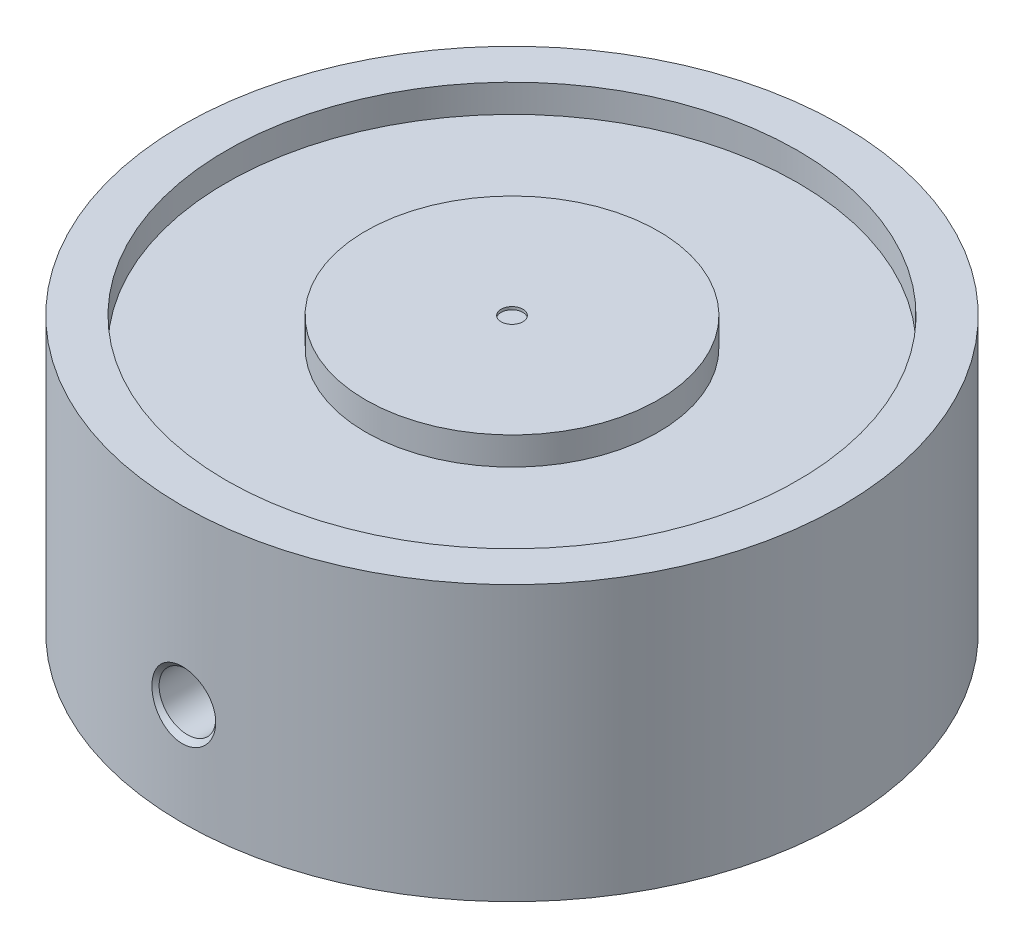
ISO-10303-21;
HEADER;
FILE_DESCRIPTION(('STEP AP214'),'2;1');
FILE_NAME('part.step','',(''),(''),'','','');
FILE_SCHEMA(('AUTOMOTIVE_DESIGN { 1 0 10303 214 1 1 1 1 }'));
ENDSEC;
DATA;
#1=APPLICATION_CONTEXT('core data for automotive mechanical design processes');
#2=APPLICATION_PROTOCOL_DEFINITION('international standard','automotive_design',2000,#1);
#3=PRODUCT_CONTEXT('',#1,'mechanical');
#4=PRODUCT('Part','Part','',(#3));
#5=PRODUCT_RELATED_PRODUCT_CATEGORY('part','',(#4));
#6=PRODUCT_DEFINITION_FORMATION('','',#4);
#7=PRODUCT_DEFINITION_CONTEXT('part definition',#1,'design');
#8=PRODUCT_DEFINITION('design','',#6,#7);
#9=PRODUCT_DEFINITION_SHAPE('','',#8);
#10=(LENGTH_UNIT() NAMED_UNIT(*) SI_UNIT(.MILLI.,.METRE.));
#11=(NAMED_UNIT(*) PLANE_ANGLE_UNIT() SI_UNIT($,.RADIAN.));
#12=(NAMED_UNIT(*) SI_UNIT($,.STERADIAN.) SOLID_ANGLE_UNIT());
#13=UNCERTAINTY_MEASURE_WITH_UNIT(LENGTH_MEASURE(1.E-05),#10,'distance_accuracy_value','');
#14=(GEOMETRIC_REPRESENTATION_CONTEXT(3) GLOBAL_UNCERTAINTY_ASSIGNED_CONTEXT((#13)) GLOBAL_UNIT_ASSIGNED_CONTEXT((#10,
#11,#12)) REPRESENTATION_CONTEXT('',''));
#15=CARTESIAN_POINT('',(0.,0.,0.));
#16=DIRECTION('',(0.,0.,1.));
#17=DIRECTION('',(1.,0.,0.));
#18=AXIS2_PLACEMENT_3D('',#15,#16,#17);
#19=CARTESIAN_POINT('',(-1.00409375,12.2555,-1.00409375));
#20=DIRECTION('',(0.,1.,0.));
#21=DIRECTION('',(0.,0.,1.));
#22=AXIS2_PLACEMENT_3D('',#19,#20,#21);
#23=PLANE('',#22);
#24=CARTESIAN_POINT('',(0.,12.2555,0.));
#25=DIRECTION('',(0.,1.,0.));
#26=DIRECTION('',(0.,0.,1.));
#27=AXIS2_PLACEMENT_3D('',#24,#25,#26);
#28=CIRCLE('',#27,0.9921875);
#29=CARTESIAN_POINT('',(0.,12.2555,0.9921875));
#30=VERTEX_POINT('',#29);
#31=EDGE_CURVE('E20',#30,#30,#28,.F.);
#32=ORIENTED_EDGE('',*,*,#31,.F.);
#33=EDGE_LOOP('',(#32));
#34=FACE_BOUND('',#33,.T.);
#35=ADVANCED_FACE('F16',(#34),#23,.T.);
#36=CARTESIAN_POINT('',(0.,12.2555,0.));
#37=DIRECTION('',(0.,1.,0.));
#38=DIRECTION('',(0.,0.,1.));
#39=AXIS2_PLACEMENT_3D('',#36,#37,#38);
#40=CYLINDRICAL_SURFACE('',#39,0.9921875);
#41=CARTESIAN_POINT('',(0.,12.5095,0.));
#42=DIRECTION('',(0.,1.,0.));
#43=DIRECTION('',(0.,0.,1.));
#44=AXIS2_PLACEMENT_3D('',#41,#42,#43);
#45=CIRCLE('',#44,0.9921875);
#46=CARTESIAN_POINT('',(0.,12.5095,0.9921875));
#47=VERTEX_POINT('',#46);
#48=EDGE_CURVE('E49',#47,#47,#45,.F.);
#49=ORIENTED_EDGE('',*,*,#48,.F.);
#50=EDGE_LOOP('',(#49));
#51=FACE_BOUND('',#50,.T.);
#52=ORIENTED_EDGE('',*,*,#31,.T.);
#53=EDGE_LOOP('',(#52));
#54=FACE_BOUND('',#53,.T.);
#55=ADVANCED_FACE('F166',(#51,#54),#40,.F.);
#56=CARTESIAN_POINT('',(-13.49502,12.5095,-13.49502));
#57=DIRECTION('',(0.,1.,0.));
#58=DIRECTION('',(0.,0.,1.));
#59=AXIS2_PLACEMENT_3D('',#56,#57,#58);
#60=PLANE('',#59);
#61=ORIENTED_EDGE('',*,*,#48,.T.);
#62=EDGE_LOOP('',(#61));
#63=FACE_BOUND('',#62,.T.);
#64=CARTESIAN_POINT('',(0.,12.5095,0.));
#65=DIRECTION('',(0.,1.,0.));
#66=DIRECTION('',(0.,0.,1.));
#67=AXIS2_PLACEMENT_3D('',#64,#65,#66);
#68=CIRCLE('',#67,13.335);
#69=CARTESIAN_POINT('',(0.,12.5095,13.335));
#70=VERTEX_POINT('',#69);
#71=EDGE_CURVE('E43',#70,#70,#68,.T.);
#72=ORIENTED_EDGE('',*,*,#71,.T.);
#73=EDGE_LOOP('',(#72));
#74=FACE_BOUND('',#73,.T.);
#75=ADVANCED_FACE('F36',(#63,#74),#60,.T.);
#76=CARTESIAN_POINT('',(0.,3.5055892042,0.));
#77=DIRECTION('',(0.,-1.,0.));
#78=DIRECTION('',(0.,0.,-1.));
#79=AXIS2_PLACEMENT_3D('',#76,#77,#78);
#80=CONICAL_SURFACE('',#79,0.,1.02974425840082);
#81=CARTESIAN_POINT('',(0.,3.5055892042,0.));
#82=VERTEX_POINT('',#81);
#83=VERTEX_LOOP('',#82);
#84=FACE_BOUND('',#83,.T.);
#85=CARTESIAN_POINT('',(0.,1.4605,0.));
#86=DIRECTION('',(0.,-1.,0.));
#87=DIRECTION('',(0.,0.,-1.));
#88=AXIS2_PLACEMENT_3D('',#85,#86,#87);
#89=CIRCLE('',#88,3.4036);
#90=CARTESIAN_POINT('',(0.,1.4605,-3.4036));
#91=VERTEX_POINT('',#90);
#92=EDGE_CURVE('E40',#91,#91,#89,.F.);
#93=ORIENTED_EDGE('',*,*,#92,.F.);
#94=EDGE_LOOP('',(#93));
#95=FACE_BOUND('',#94,.T.);
#96=ADVANCED_FACE('F32',(#84,#95),#80,.F.);
#97=CARTESIAN_POINT('',(0.,9.9695,0.));
#98=DIRECTION('',(0.,1.,0.));
#99=DIRECTION('',(0.,0.,1.));
#100=AXIS2_PLACEMENT_3D('',#97,#98,#99);
#101=CYLINDRICAL_SURFACE('',#100,13.335);
#102=CARTESIAN_POINT('',(0.,9.9695,0.));
#103=DIRECTION('',(0.,1.,0.));
#104=DIRECTION('',(0.,0.,1.));
#105=AXIS2_PLACEMENT_3D('',#102,#103,#104);
#106=CIRCLE('',#105,13.335);
#107=CARTESIAN_POINT('',(0.,9.9695,13.335));
#108=VERTEX_POINT('',#107);
#109=EDGE_CURVE('E42',#108,#108,#106,.F.);
#110=ORIENTED_EDGE('',*,*,#109,.F.);
#111=EDGE_LOOP('',(#110));
#112=FACE_BOUND('',#111,.T.);
#113=ORIENTED_EDGE('',*,*,#71,.F.);
#114=EDGE_LOOP('',(#113));
#115=FACE_BOUND('',#114,.T.);
#116=ADVANCED_FACE('F35',(#112,#115),#101,.T.);
#117=CARTESIAN_POINT('',(0.,1.4605,0.));
#118=DIRECTION('',(0.,-1.,0.));
#119=DIRECTION('',(0.,0.,-1.));
#120=AXIS2_PLACEMENT_3D('',#117,#118,#119);
#121=CYLINDRICAL_SURFACE('',#120,3.4036);
#122=ORIENTED_EDGE('',*,*,#92,.T.);
#123=EDGE_LOOP('',(#122));
#124=FACE_BOUND('',#123,.T.);
#125=CARTESIAN_POINT('',(0.,-11.8490999999999,0.));
#126=DIRECTION('',(0.,-1.,0.));
#127=DIRECTION('',(0.,0.,-1.));
#128=AXIS2_PLACEMENT_3D('',#125,#126,#127);
#129=CIRCLE('',#128,3.4036);
#130=CARTESIAN_POINT('',(0.,-11.8491,-3.4036));
#131=VERTEX_POINT('',#130);
#132=EDGE_CURVE('E46',#131,#131,#129,.F.);
#133=ORIENTED_EDGE('',*,*,#132,.F.);
#134=EDGE_LOOP('',(#133));
#135=FACE_BOUND('',#134,.T.);
#136=ADVANCED_FACE('F141',(#124,#135),#121,.F.);
#137=CARTESIAN_POINT('',(-26.34742,9.9695,-26.34742));
#138=DIRECTION('',(0.,1.,0.));
#139=DIRECTION('',(0.,0.,1.));
#140=AXIS2_PLACEMENT_3D('',#137,#138,#139);
#141=PLANE('',#140);
#142=ORIENTED_EDGE('',*,*,#109,.T.);
#143=EDGE_LOOP('',(#142));
#144=FACE_BOUND('',#143,.T.);
#145=CARTESIAN_POINT('',(0.,9.9695,0.));
#146=DIRECTION('',(0.,1.,0.));
#147=DIRECTION('',(0.,0.,1.));
#148=AXIS2_PLACEMENT_3D('',#145,#146,#147);
#149=CIRCLE('',#148,26.035);
#150=CARTESIAN_POINT('',(0.,9.9695,26.035));
#151=VERTEX_POINT('',#150);
#152=EDGE_CURVE('E189',#151,#151,#149,.F.);
#153=ORIENTED_EDGE('',*,*,#152,.F.);
#154=EDGE_LOOP('',(#153));
#155=FACE_BOUND('',#154,.T.);
#156=ADVANCED_FACE('F133',(#144,#155),#141,.T.);
#157=CARTESIAN_POINT('',(0.,-11.8491,0.));
#158=DIRECTION('',(0.,-1.,0.));
#159=DIRECTION('',(0.,0.,-1.));
#160=AXIS2_PLACEMENT_3D('',#157,#158,#159);
#161=CONICAL_SURFACE('',#160,3.4036,0.785398163397447);
#162=ORIENTED_EDGE('',*,*,#132,.T.);
#163=EDGE_LOOP('',(#162));
#164=FACE_BOUND('',#163,.T.);
#165=CARTESIAN_POINT('',(0.,-12.5095,0.));
#166=DIRECTION('',(0.,-1.,0.));
#167=DIRECTION('',(0.,0.,-1.));
#168=AXIS2_PLACEMENT_3D('',#165,#166,#167);
#169=CIRCLE('',#168,4.06399999999995);
#170=CARTESIAN_POINT('',(0.,-12.5095,-4.06399999999995));
#171=VERTEX_POINT('',#170);
#172=EDGE_CURVE('E192',#171,#171,#169,.T.);
#173=ORIENTED_EDGE('',*,*,#172,.T.);
#174=EDGE_LOOP('',(#173));
#175=FACE_BOUND('',#174,.T.);
#176=ADVANCED_FACE('F126',(#164,#175),#161,.F.);
#177=CARTESIAN_POINT('',(0.,9.9695,0.));
#178=DIRECTION('',(0.,1.,0.));
#179=DIRECTION('',(0.,0.,1.));
#180=AXIS2_PLACEMENT_3D('',#177,#178,#179);
#181=CYLINDRICAL_SURFACE('',#180,26.035);
#182=CARTESIAN_POINT('',(0.,12.5095,0.));
#183=DIRECTION('',(0.,1.,0.));
#184=DIRECTION('',(0.,0.,1.));
#185=AXIS2_PLACEMENT_3D('',#182,#183,#184);
#186=CIRCLE('',#185,26.035);
#187=CARTESIAN_POINT('',(0.,12.5095,26.035));
#188=VERTEX_POINT('',#187);
#189=EDGE_CURVE('E195',#188,#188,#186,.F.);
#190=ORIENTED_EDGE('',*,*,#189,.F.);
#191=EDGE_LOOP('',(#190));
#192=FACE_BOUND('',#191,.T.);
#193=ORIENTED_EDGE('',*,*,#152,.T.);
#194=EDGE_LOOP('',(#193));
#195=FACE_BOUND('',#194,.T.);
#196=ADVANCED_FACE('F119',(#192,#195),#181,.F.);
#197=CARTESIAN_POINT('',(-30.4023522,-12.5095,-30.4023522));
#198=DIRECTION('',(0.,1.,0.));
#199=DIRECTION('',(0.,0.,1.));
#200=AXIS2_PLACEMENT_3D('',#197,#198,#199);
#201=PLANE('',#200);
#202=ORIENTED_EDGE('',*,*,#172,.F.);
#203=EDGE_LOOP('',(#202));
#204=FACE_BOUND('',#203,.T.);
#205=CARTESIAN_POINT('',(0.,-12.5095,0.));
#206=DIRECTION('',(0.,-1.,0.));
#207=DIRECTION('',(0.,0.,-1.));
#208=AXIS2_PLACEMENT_3D('',#205,#206,#207);
#209=CIRCLE('',#208,30.04185);
#210=CARTESIAN_POINT('',(0.,-12.5095,-30.04185));
#211=VERTEX_POINT('',#210);
#212=EDGE_CURVE('E197',#211,#211,#209,.T.);
#213=ORIENTED_EDGE('',*,*,#212,.T.);
#214=EDGE_LOOP('',(#213));
#215=FACE_BOUND('',#214,.T.);
#216=ADVANCED_FACE('F112',(#204,#215),#201,.F.);
#217=CARTESIAN_POINT('',(-30.4023522,12.5095,-30.4023522));
#218=DIRECTION('',(0.,1.,0.));
#219=DIRECTION('',(0.,0.,1.));
#220=AXIS2_PLACEMENT_3D('',#217,#218,#219);
#221=PLANE('',#220);
#222=ORIENTED_EDGE('',*,*,#189,.T.);
#223=EDGE_LOOP('',(#222));
#224=FACE_BOUND('',#223,.T.);
#225=CARTESIAN_POINT('',(0.,12.5095,0.));
#226=DIRECTION('',(0.,-1.,0.));
#227=DIRECTION('',(0.,0.,-1.));
#228=AXIS2_PLACEMENT_3D('',#225,#226,#227);
#229=CIRCLE('',#228,30.04185);
#230=CARTESIAN_POINT('',(0.,12.5095,-30.04185));
#231=VERTEX_POINT('',#230);
#232=EDGE_CURVE('E60',#231,#231,#229,.F.);
#233=ORIENTED_EDGE('',*,*,#232,.T.);
#234=EDGE_LOOP('',(#233));
#235=FACE_BOUND('',#234,.T.);
#236=ADVANCED_FACE('F18',(#224,#235),#221,.T.);
#237=CARTESIAN_POINT('',(0.,12.5095,0.));
#238=DIRECTION('',(0.,-1.,0.));
#239=DIRECTION('',(0.,0.,-1.));
#240=AXIS2_PLACEMENT_3D('',#237,#238,#239);
#241=CYLINDRICAL_SURFACE('',#240,30.04185);
#242=ORIENTED_EDGE('',*,*,#212,.F.);
#243=EDGE_LOOP('',(#242));
#244=FACE_BOUND('',#243,.T.);
#245=CARTESIAN_POINT('',(-2.90701938102084,-3.21309974719248,29.9008693810208));
#246=CARTESIAN_POINT('',(-2.90701466575819,-3.39106134422876,29.9008708116393));
#247=CARTESIAN_POINT('',(-2.89209141647851,-3.56908913245919,29.9023322521782));
#248=CARTESIAN_POINT('',(-2.8326889731572,-3.92018869767745,29.9080171469593));
#249=CARTESIAN_POINT('',(-2.78819120462545,-4.09325728870451,29.9122423369678));
#250=CARTESIAN_POINT('',(-2.67065304054812,-4.42921519042932,29.9229649011047));
#251=CARTESIAN_POINT('',(-2.59763534161678,-4.59211247634534,29.9294604679999));
#252=CARTESIAN_POINT('',(-2.42473663554425,-4.90288406404577,29.9439625630061));
#253=CARTESIAN_POINT('',(-2.32486202959417,-5.0507619340667,29.9519687309385));
#254=CARTESIAN_POINT('',(-2.10325484559262,-5.32354894124232,29.9683349620311));
#255=CARTESIAN_POINT('',(-1.98207084447528,-5.44890384522508,29.9766828408072));
#256=CARTESIAN_POINT('',(-1.71945231647923,-5.67639507957893,29.9928905441293));
#257=CARTESIAN_POINT('',(-1.57801626860532,-5.77852966453557,30.0007503319544));
#258=CARTESIAN_POINT('',(-1.28541520240291,-5.9518511133594,30.0146794110718));
#259=CARTESIAN_POINT('',(-1.13492696562868,-6.02417675988089,30.0208110038938));
#260=CARTESIAN_POINT('',(-0.823652643988981,-6.14109062487776,30.030958097121));
#261=CARTESIAN_POINT('',(-0.662886642341278,-6.18573121778938,30.0349775909691));
#262=CARTESIAN_POINT('',(-0.417209317301813,-6.23076819327773,30.0390669018534));
#263=CARTESIAN_POINT('',(-0.334189428977145,-6.24212741269829,30.0401069141277));
#264=CARTESIAN_POINT('',(-0.167458990930617,-6.25729500176058,30.0414988779427));
#265=CARTESIAN_POINT('',(-0.0837484936323983,-6.2611039393383,30.0418508812357));
#266=CARTESIAN_POINT('',(0.151325292577853,-6.2610921690496,30.0418484076936));
#267=CARTESIAN_POINT('',(0.302774631453907,-6.2486351237024,30.0406946847928));
#268=CARTESIAN_POINT('',(0.601721182252781,-6.19920373586845,30.0361968229132));
#269=CARTESIAN_POINT('',(0.749212510909281,-6.16219479469729,30.0328495929117));
#270=CARTESIAN_POINT('',(1.04014280312083,-6.06359349704171,30.0242001851937));
#271=CARTESIAN_POINT('',(1.18336457569443,-6.00136388697314,30.0188476262427));
#272=CARTESIAN_POINT('',(1.45769231862119,-5.85451088401947,30.0067787691962));
#273=CARTESIAN_POINT('',(1.58879950023848,-5.76988973320397,30.0000626076542));
#274=CARTESIAN_POINT('',(1.8397415765954,-5.57792797453848,29.9857367800663));
#275=CARTESIAN_POINT('',(1.95909214459001,-5.46995641854923,29.9781056530212));
#276=CARTESIAN_POINT('',(2.17896481260718,-5.23627388227085,29.9629277910211));
#277=CARTESIAN_POINT('',(2.27948030861383,-5.11055670694055,29.9553810865354));
#278=CARTESIAN_POINT('',(2.46378412078416,-4.83865900991901,29.9407996626287));
#279=CARTESIAN_POINT('',(2.54656806611231,-4.69179569375851,29.9338054978109));
#280=CARTESIAN_POINT('',(2.68738715881765,-4.38665207798738,29.9214926673158));
#281=CARTESIAN_POINT('',(2.74543051570801,-4.22837558595296,29.9161734460059));
#282=CARTESIAN_POINT('',(2.82918407275589,-3.92781303745976,29.9083593587104));
#283=CARTESIAN_POINT('',(2.85833275606482,-3.7864802424562,29.9055692360487));
#284=CARTESIAN_POINT('',(2.89725308428778,-3.50114614218442,29.9018235957173));
#285=CARTESIAN_POINT('',(2.90702319756431,-3.35714462689453,29.9008682230622));
#286=CARTESIAN_POINT('',(2.90701466583647,-3.03513814916761,29.9008708116317));
#287=CARTESIAN_POINT('',(2.89209141663429,-2.85711036092749,29.902332252163));
#288=CARTESIAN_POINT('',(2.83268897346567,-2.50601079567927,29.90801714693));
#289=CARTESIAN_POINT('',(2.78819120500968,-2.33294220463183,29.9122423369319));
#290=CARTESIAN_POINT('',(2.67065304107969,-1.9969843028522,29.9229649010571));
#291=CARTESIAN_POINT('',(2.59763534221968,-1.83408701690184,29.9294604679474));
#292=CARTESIAN_POINT('',(2.42473663628349,-1.52331542911951,29.943962562946));
#293=CARTESIAN_POINT('',(2.32486203039826,-1.37543755905111,29.9519687308758));
#294=CARTESIAN_POINT('',(2.10325484651328,-1.10265055176585,29.9683349619662));
#295=CARTESIAN_POINT('',(1.98207084544709,-0.977295647721803,29.9766828407428));
#296=CARTESIAN_POINT('',(1.71945231754314,-0.749804413237683,29.9928905440682));
#297=CARTESIAN_POINT('',(1.57801626971031,-0.647669828211902,30.0007503318962));
#298=CARTESIAN_POINT('',(1.28541520357381,-0.47434837924515,30.0146794110215));
#299=CARTESIAN_POINT('',(1.1349269668248,-0.40202273265043,30.0208110038484));
#300=CARTESIAN_POINT('',(0.823652645219571,-0.28510886750272,30.0309580970872));
#301=CARTESIAN_POINT('',(0.662886643580865,-0.240468274514212,30.0349775909418));
#302=CARTESIAN_POINT('',(0.417209317303221,-0.195431298683879,30.0390669018568));
#303=CARTESIAN_POINT('',(0.334189427719329,-0.184072079110369,30.0401069141452));
#304=CARTESIAN_POINT('',(0.167458987140447,-0.168904489971513,30.0414988779674));
#305=CARTESIAN_POINT('',(0.0837484885691004,-0.165095552470139,30.0418508812534));
#306=CARTESIAN_POINT('',(-0.151325298949244,-0.165107323296426,30.0418484076617));
#307=CARTESIAN_POINT('',(-0.302774637837606,-0.177564368996905,30.0406946847283));
#308=CARTESIAN_POINT('',(-0.601721188599701,-0.226995757538309,30.0361968227859));
#309=CARTESIAN_POINT('',(-0.749212517207124,-0.264004699063079,30.0328495927542));
#310=CARTESIAN_POINT('',(-1.04014280923913,-0.362605997415846,30.0242001849813));
#311=CARTESIAN_POINT('',(-1.18336458168194,-0.424835607824011,30.018847626006));
#312=CARTESIAN_POINT('',(-1.45769232429718,-0.571688611427306,30.0067787689198));
#313=CARTESIAN_POINT('',(-1.5887995057337,-0.656309762552947,30.0000626073623));
#314=CARTESIAN_POINT('',(-1.83974158170368,-0.848271521829881,29.9857367797521));
#315=CARTESIAN_POINT('',(-1.95909214948773,-0.956243078123229,29.9781056527003));
#316=CARTESIAN_POINT('',(-2.17896481703897,-1.1899256149726,29.962927790698));
#317=CARTESIAN_POINT('',(-2.27948031279018,-1.31564279056982,29.9553810862167));
#318=CARTESIAN_POINT('',(-2.4637841244005,-1.58754048809737,29.9407996623302));
#319=CARTESIAN_POINT('',(-2.54656806942161,-1.7344038044953,29.9338054975285));
#320=CARTESIAN_POINT('',(-2.68738716147515,-2.03954742068802,29.9214926670763));
#321=CARTESIAN_POINT('',(-2.74543051802121,-2.19782391290641,29.916173445793));
#322=CARTESIAN_POINT('',(-2.82918407412786,-2.49838646070004,29.9083593585799));
#323=CARTESIAN_POINT('',(-2.85833275697879,-2.6397192547906,29.9055692359611));
#324=CARTESIAN_POINT('',(-2.8972530845474,-2.92505335317312,29.9018235956919));
#325=CARTESIAN_POINT('',(-2.90702319762764,-3.06905486748674,29.9008682230561));
#326=CARTESIAN_POINT('',(-2.90701938102084,-3.21309974719248,29.9008693810208));
#327=B_SPLINE_CURVE_WITH_KNOTS('',3,(#245,#246,#247,#248,#249,#250,#251,#252,#253,#254,#255,
#256,#257,#258,#259,#260,#261,#262,#263,#264,#265,#266,#267,#268,#269,#270,#271,#272,#273,#274,
#275,#276,#277,#278,#279,#280,#281,#282,#283,#284,#285,#286,#287,#288,#289,#290,#291,#292,#293,
#294,#295,#296,#297,#298,#299,#300,#301,#302,#303,#304,#305,#306,#307,#308,#309,#310,#311,#312,
#313,#314,#315,#316,#317,#318,#319,#320,#321,#322,#323,#324,#325,#326),.UNSPECIFIED.,.T.,.F.,(4,
2,2,2,2,2,2,2,2,2,2,2,2,2,2,2,2,2,2,2,2,2,2,2,2,2,2,2,2,2,2,2,2,2,2,2,2,2,2,2,4),(0.,
0.533371078501435,1.06707746150989,1.60035997504456,2.1335154962105,2.65454946951807,
3.17562259473235,3.67436293721857,4.1721568640531,4.42325740933956,4.67433906599992,
5.12801895808166,5.58233954062374,6.04893645283562,6.51548666227017,6.99671309964241,
7.47810795180627,7.98205760247925,8.48583990029686,8.91752461738253,9.34924345247376,
9.88261453098674,10.4163209139969,10.9496034275377,11.4827589487126,12.0037929220456,
12.524866047282,13.0236063897947,13.5214003166685,13.7725008657453,14.0235825261951,
14.4772624184026,14.9315830010605,15.3981799133218,15.8647301228078,16.3459565603239,
16.8273514126332,17.3313010634717,17.8350833614457,18.266768075598,18.6984869077548),.UNSPECIFIED.);
#328=CARTESIAN_POINT('',(-2.90701938102084,-3.21309974719248,29.9008693810208));
#329=VERTEX_POINT('',#328);
#330=EDGE_CURVE('E53',#329,#329,#327,.T.);
#331=ORIENTED_EDGE('',*,*,#330,.F.);
#332=EDGE_LOOP('',(#331));
#333=FACE_BOUND('',#332,.T.);
#334=ORIENTED_EDGE('',*,*,#232,.F.);
#335=EDGE_LOOP('',(#334));
#336=FACE_BOUND('',#335,.T.);
#337=ADVANCED_FACE('F62',(#244,#333,#336),#241,.T.);
#338=CARTESIAN_POINT('',(0.,-3.213099746,23.4117792114));
#339=DIRECTION('',(0.,0.,1.));
#340=DIRECTION('',(0.,-1.,0.));
#341=AXIS2_PLACEMENT_3D('',#338,#339,#340);
#342=CONICAL_SURFACE('',#341,0.,1.0297442570239);
#343=CARTESIAN_POINT('',(0.,-3.213099746,23.4117792114));
#344=VERTEX_POINT('',#343);
#345=VERTEX_LOOP('',#344);
#346=FACE_BOUND('',#345,.T.);
#347=CARTESIAN_POINT('',(0.,-3.213099746,24.96185));
#348=DIRECTION('',(0.,0.,1.));
#349=DIRECTION('',(1.,0.,0.));
#350=AXIS2_PLACEMENT_3D('',#347,#348,#349);
#351=CIRCLE('',#350,2.579751);
#352=CARTESIAN_POINT('',(2.579751,-3.213099746,24.96185));
#353=VERTEX_POINT('',#352);
#354=EDGE_CURVE('E26',#353,#353,#351,.F.);
#355=ORIENTED_EDGE('',*,*,#354,.F.);
#356=EDGE_LOOP('',(#355));
#357=FACE_BOUND('',#356,.T.);
#358=ADVANCED_FACE('F71',(#346,#357),#342,.F.);
#359=CARTESIAN_POINT('',(0.,-3.213099746,29.573601));
#360=DIRECTION('',(0.,0.,1.));
#361=DIRECTION('',(1.,0.,0.));
#362=AXIS2_PLACEMENT_3D('',#359,#360,#361);
#363=CONICAL_SURFACE('',#362,2.579751,0.785398163397458);
#364=ORIENTED_EDGE('',*,*,#330,.T.);
#365=EDGE_LOOP('',(#364));
#366=FACE_BOUND('',#365,.T.);
#367=CARTESIAN_POINT('',(0.,-3.213099746,29.573601));
#368=DIRECTION('',(0.,0.,1.));
#369=DIRECTION('',(1.,0.,0.));
#370=AXIS2_PLACEMENT_3D('',#367,#368,#369);
#371=CIRCLE('',#370,2.579751);
#372=CARTESIAN_POINT('',(2.579751,-3.213099746,29.573601));
#373=VERTEX_POINT('',#372);
#374=EDGE_CURVE('E11',#373,#373,#371,.T.);
#375=ORIENTED_EDGE('',*,*,#374,.F.);
#376=EDGE_LOOP('',(#375));
#377=FACE_BOUND('',#376,.T.);
#378=ADVANCED_FACE('F66',(#366,#377),#363,.F.);
#379=CARTESIAN_POINT('',(0.,-3.213099746,24.96185));
#380=DIRECTION('',(0.,0.,1.));
#381=DIRECTION('',(0.,-1.,0.));
#382=AXIS2_PLACEMENT_3D('',#379,#380,#381);
#383=CYLINDRICAL_SURFACE('',#382,2.579751);
#384=ORIENTED_EDGE('',*,*,#374,.T.);
#385=EDGE_LOOP('',(#384));
#386=FACE_BOUND('',#385,.T.);
#387=ORIENTED_EDGE('',*,*,#354,.T.);
#388=EDGE_LOOP('',(#387));
#389=FACE_BOUND('',#388,.T.);
#390=ADVANCED_FACE('F70',(#386,#389),#383,.F.);
#391=CLOSED_SHELL('',(#35,#55,#75,#96,#116,#136,#156,#176,#196,#216,#236,#337,#358,#378,#390));
#392=MANIFOLD_SOLID_BREP('B1',#391);
#393=ADVANCED_BREP_SHAPE_REPRESENTATION('',(#18,#392),#14);
#394=SHAPE_DEFINITION_REPRESENTATION(#9,#393);
ENDSEC;
END-ISO-10303-21;
